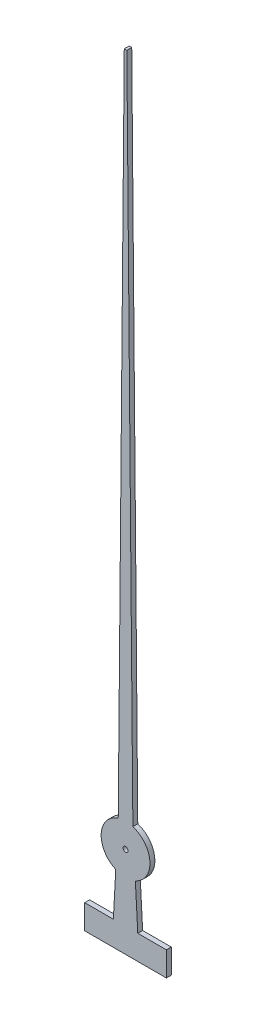
ISO-10303-21;
HEADER;
FILE_DESCRIPTION(('STEP AP214'),'2;1');
FILE_NAME('part.step','',(''),(''),'','','');
FILE_SCHEMA(('AUTOMOTIVE_DESIGN { 1 0 10303 214 1 1 1 1 }'));
ENDSEC;
DATA;
#1=APPLICATION_CONTEXT('core data for automotive mechanical design processes');
#2=APPLICATION_PROTOCOL_DEFINITION('international standard','automotive_design',2000,#1);
#3=PRODUCT_CONTEXT('',#1,'mechanical');
#4=PRODUCT('Part','Part','',(#3));
#5=PRODUCT_RELATED_PRODUCT_CATEGORY('part','',(#4));
#6=PRODUCT_DEFINITION_FORMATION('','',#4);
#7=PRODUCT_DEFINITION_CONTEXT('part definition',#1,'design');
#8=PRODUCT_DEFINITION('design','',#6,#7);
#9=PRODUCT_DEFINITION_SHAPE('','',#8);
#10=(LENGTH_UNIT() NAMED_UNIT(*) SI_UNIT(.MILLI.,.METRE.));
#11=(NAMED_UNIT(*) PLANE_ANGLE_UNIT() SI_UNIT($,.RADIAN.));
#12=(NAMED_UNIT(*) SI_UNIT($,.STERADIAN.) SOLID_ANGLE_UNIT());
#13=UNCERTAINTY_MEASURE_WITH_UNIT(LENGTH_MEASURE(1.E-05),#10,'distance_accuracy_value','');
#14=(GEOMETRIC_REPRESENTATION_CONTEXT(3) GLOBAL_UNCERTAINTY_ASSIGNED_CONTEXT((#13)) GLOBAL_UNIT_ASSIGNED_CONTEXT((#10,
#11,#12)) REPRESENTATION_CONTEXT('',''));
#15=CARTESIAN_POINT('',(0.,0.,0.));
#16=DIRECTION('',(0.,0.,1.));
#17=DIRECTION('',(1.,0.,0.));
#18=AXIS2_PLACEMENT_3D('',#15,#16,#17);
#19=CARTESIAN_POINT('',(0.,0.,0.1));
#20=DIRECTION('',(0.,0.,1.));
#21=DIRECTION('',(1.,0.,0.));
#22=AXIS2_PLACEMENT_3D('',#19,#20,#21);
#23=PLANE('',#22);
#24=CARTESIAN_POINT('',(0.,0.,0.1));
#25=DIRECTION('',(0.,0.,1.));
#26=DIRECTION('',(1.,0.,0.));
#27=AXIS2_PLACEMENT_3D('',#24,#25,#26);
#28=CIRCLE('',#27,0.5);
#29=CARTESIAN_POINT('',(0.200773833253495,-0.457919062587154,0.1));
#30=VERTEX_POINT('',#29);
#31=CARTESIAN_POINT('',(0.150000000000001,0.476969600708472,0.1));
#32=VERTEX_POINT('',#31);
#33=EDGE_CURVE('E177',#30,#32,#28,.T.);
#34=ORIENTED_EDGE('',*,*,#33,.T.);
#35=DIRECTION('',(-0.00900450339221929,0.999959458637529,0.));
#36=VECTOR('',#35,1.);
#37=CARTESIAN_POINT('',(0.150000000000001,0.476969600708472,0.1));
#38=LINE('',#37,#36);
#39=CARTESIAN_POINT('',(0.0265262633769825,14.1888563590826,0.1));
#40=VERTEX_POINT('',#39);
#41=EDGE_CURVE('E105',#32,#40,#38,.T.);
#42=ORIENTED_EDGE('',*,*,#41,.T.);
#43=DIRECTION('',(-1.,0.,0.));
#44=VECTOR('',#43,1.);
#45=CARTESIAN_POINT('',(-0.0265262633769822,14.1888563590826,0.1));
#46=LINE('',#45,#44);
#47=CARTESIAN_POINT('',(-0.0265262633769822,14.1888563590826,0.1));
#48=VERTEX_POINT('',#47);
#49=EDGE_CURVE('E204',#40,#48,#46,.T.);
#50=ORIENTED_EDGE('',*,*,#49,.T.);
#51=DIRECTION('',(-0.0090045033922193,-0.999959458637529,0.));
#52=VECTOR('',#51,1.);
#53=CARTESIAN_POINT('',(-0.150000000000001,0.476969600708472,0.1));
#54=LINE('',#53,#52);
#55=CARTESIAN_POINT('',(-0.150000000000001,0.476969600708472,0.1));
#56=VERTEX_POINT('',#55);
#57=EDGE_CURVE('E223',#48,#56,#54,.T.);
#58=ORIENTED_EDGE('',*,*,#57,.T.);
#59=CARTESIAN_POINT('',(0.,0.,0.1));
#60=DIRECTION('',(0.,0.,1.));
#61=DIRECTION('',(1.,0.,0.));
#62=AXIS2_PLACEMENT_3D('',#59,#60,#61);
#63=CIRCLE('',#62,0.5);
#64=CARTESIAN_POINT('',(-0.200773833253495,-0.457919062587154,0.1));
#65=VERTEX_POINT('',#64);
#66=EDGE_CURVE('E220',#56,#65,#63,.T.);
#67=ORIENTED_EDGE('',*,*,#66,.T.);
#68=DIRECTION('',(-0.0542301129075481,-0.998528464718975,0.));
#69=VECTOR('',#68,1.);
#70=CARTESIAN_POINT('',(-0.200773833253495,-0.457919062587154,0.1));
#71=LINE('',#70,#69);
#72=CARTESIAN_POINT('',(-0.25,-1.36431084512291,0.1));
#73=VERTEX_POINT('',#72);
#74=EDGE_CURVE('E222',#65,#73,#71,.T.);
#75=ORIENTED_EDGE('',*,*,#74,.T.);
#76=DIRECTION('',(-1.,0.,0.));
#77=VECTOR('',#76,1.);
#78=CARTESIAN_POINT('',(-0.25,-1.36431084512291,0.1));
#79=LINE('',#78,#77);
#80=CARTESIAN_POINT('',(-0.836414696541291,-1.36431084512291,0.1));
#81=VERTEX_POINT('',#80);
#82=EDGE_CURVE('E225',#73,#81,#79,.T.);
#83=ORIENTED_EDGE('',*,*,#82,.T.);
#84=DIRECTION('',(0.,-1.,0.));
#85=VECTOR('',#84,1.);
#86=CARTESIAN_POINT('',(-0.836414696541291,-1.36431084512291,0.1));
#87=LINE('',#86,#85);
#88=CARTESIAN_POINT('',(-0.836414696541291,-1.86431084512291,0.1));
#89=VERTEX_POINT('',#88);
#90=EDGE_CURVE('E231',#81,#89,#87,.T.);
#91=ORIENTED_EDGE('',*,*,#90,.T.);
#92=DIRECTION('',(1.,0.,0.));
#93=VECTOR('',#92,1.);
#94=CARTESIAN_POINT('',(-0.836414696541291,-1.86431084512291,0.1));
#95=LINE('',#94,#93);
#96=CARTESIAN_POINT('',(0.836414696541291,-1.86431084512291,0.1));
#97=VERTEX_POINT('',#96);
#98=EDGE_CURVE('E136',#89,#97,#95,.T.);
#99=ORIENTED_EDGE('',*,*,#98,.T.);
#100=DIRECTION('',(0.,1.,0.));
#101=VECTOR('',#100,1.);
#102=CARTESIAN_POINT('',(0.836414696541291,-1.36431084512291,0.1));
#103=LINE('',#102,#101);
#104=CARTESIAN_POINT('',(0.836414696541291,-1.36431084512291,0.1));
#105=VERTEX_POINT('',#104);
#106=EDGE_CURVE('E130',#97,#105,#103,.T.);
#107=ORIENTED_EDGE('',*,*,#106,.T.);
#108=DIRECTION('',(-1.,0.,0.));
#109=VECTOR('',#108,1.);
#110=CARTESIAN_POINT('',(0.25,-1.36431084512291,0.1));
#111=LINE('',#110,#109);
#112=CARTESIAN_POINT('',(0.25,-1.36431084512291,0.1));
#113=VERTEX_POINT('',#112);
#114=EDGE_CURVE('E134',#105,#113,#111,.T.);
#115=ORIENTED_EDGE('',*,*,#114,.T.);
#116=DIRECTION('',(-0.0542301129075481,0.998528464718975,0.));
#117=VECTOR('',#116,1.);
#118=CARTESIAN_POINT('',(0.200773833253495,-0.457919062587154,0.1));
#119=LINE('',#118,#117);
#120=EDGE_CURVE('E50',#113,#30,#119,.T.);
#121=ORIENTED_EDGE('',*,*,#120,.T.);
#122=EDGE_LOOP('',(#34,#42,#50,#58,#67,#75,#83,#91,#99,#107,#115,#121));
#123=FACE_BOUND('',#122,.T.);
#124=CARTESIAN_POINT('',(0.,0.,0.1));
#125=DIRECTION('',(0.,0.,1.));
#126=DIRECTION('',(1.,0.,0.));
#127=AXIS2_PLACEMENT_3D('',#124,#125,#126);
#128=CIRCLE('',#127,0.05);
#129=CARTESIAN_POINT('',(0.0500000000000001,0.,0.1));
#130=VERTEX_POINT('',#129);
#131=EDGE_CURVE('E158',#130,#130,#128,.T.);
#132=ORIENTED_EDGE('',*,*,#131,.F.);
#133=EDGE_LOOP('',(#132));
#134=FACE_BOUND('',#133,.T.);
#135=ADVANCED_FACE('F33',(#123,#134),#23,.T.);
#136=CARTESIAN_POINT('',(0.,0.,0.));
#137=DIRECTION('',(0.,0.,1.));
#138=DIRECTION('',(1.,0.,0.));
#139=AXIS2_PLACEMENT_3D('',#136,#137,#138);
#140=PLANE('',#139);
#141=CARTESIAN_POINT('',(0.,0.,0.));
#142=DIRECTION('',(0.,0.,1.));
#143=DIRECTION('',(1.,0.,0.));
#144=AXIS2_PLACEMENT_3D('',#141,#142,#143);
#145=CIRCLE('',#144,0.5);
#146=CARTESIAN_POINT('',(0.200773833253495,-0.457919062587154,0.));
#147=VERTEX_POINT('',#146);
#148=CARTESIAN_POINT('',(0.150000000000001,0.476969600708472,0.));
#149=VERTEX_POINT('',#148);
#150=EDGE_CURVE('E154',#147,#149,#145,.T.);
#151=ORIENTED_EDGE('',*,*,#150,.F.);
#152=DIRECTION('',(-0.0542301129075481,0.998528464718975,0.));
#153=VECTOR('',#152,1.);
#154=CARTESIAN_POINT('',(0.200773833253495,-0.457919062587154,0.));
#155=LINE('',#154,#153);
#156=CARTESIAN_POINT('',(0.25,-1.36431084512291,0.));
#157=VERTEX_POINT('',#156);
#158=EDGE_CURVE('E97',#157,#147,#155,.T.);
#159=ORIENTED_EDGE('',*,*,#158,.F.);
#160=DIRECTION('',(-1.,0.,0.));
#161=VECTOR('',#160,1.);
#162=CARTESIAN_POINT('',(0.25,-1.36431084512291,0.));
#163=LINE('',#162,#161);
#164=CARTESIAN_POINT('',(0.836414696541291,-1.36431084512291,0.));
#165=VERTEX_POINT('',#164);
#166=EDGE_CURVE('E91',#165,#157,#163,.T.);
#167=ORIENTED_EDGE('',*,*,#166,.F.);
#168=DIRECTION('',(0.,1.,0.));
#169=VECTOR('',#168,1.);
#170=CARTESIAN_POINT('',(0.836414696541291,-1.36431084512291,0.));
#171=LINE('',#170,#169);
#172=CARTESIAN_POINT('',(0.836414696541291,-1.86431084512291,0.));
#173=VERTEX_POINT('',#172);
#174=EDGE_CURVE('E144',#173,#165,#171,.T.);
#175=ORIENTED_EDGE('',*,*,#174,.F.);
#176=DIRECTION('',(1.,0.,0.));
#177=VECTOR('',#176,1.);
#178=CARTESIAN_POINT('',(-0.836414696541291,-1.86431084512291,0.));
#179=LINE('',#178,#177);
#180=CARTESIAN_POINT('',(-0.836414696541291,-1.86431084512291,0.));
#181=VERTEX_POINT('',#180);
#182=EDGE_CURVE('E172',#181,#173,#179,.T.);
#183=ORIENTED_EDGE('',*,*,#182,.F.);
#184=DIRECTION('',(0.,-1.,0.));
#185=VECTOR('',#184,1.);
#186=CARTESIAN_POINT('',(-0.836414696541291,-1.36431084512291,0.));
#187=LINE('',#186,#185);
#188=CARTESIAN_POINT('',(-0.836414696541291,-1.36431084512291,0.));
#189=VERTEX_POINT('',#188);
#190=EDGE_CURVE('E170',#189,#181,#187,.T.);
#191=ORIENTED_EDGE('',*,*,#190,.F.);
#192=DIRECTION('',(-1.,0.,0.));
#193=VECTOR('',#192,1.);
#194=CARTESIAN_POINT('',(-0.25,-1.36431084512291,0.));
#195=LINE('',#194,#193);
#196=CARTESIAN_POINT('',(-0.25,-1.36431084512291,0.));
#197=VERTEX_POINT('',#196);
#198=EDGE_CURVE('E168',#197,#189,#195,.T.);
#199=ORIENTED_EDGE('',*,*,#198,.F.);
#200=DIRECTION('',(-0.0542301129075481,-0.998528464718975,0.));
#201=VECTOR('',#200,1.);
#202=CARTESIAN_POINT('',(-0.200773833253495,-0.457919062587154,0.));
#203=LINE('',#202,#201);
#204=CARTESIAN_POINT('',(-0.200773833253495,-0.457919062587154,0.));
#205=VERTEX_POINT('',#204);
#206=EDGE_CURVE('E166',#205,#197,#203,.T.);
#207=ORIENTED_EDGE('',*,*,#206,.F.);
#208=CARTESIAN_POINT('',(0.,0.,0.));
#209=DIRECTION('',(0.,0.,1.));
#210=DIRECTION('',(1.,0.,0.));
#211=AXIS2_PLACEMENT_3D('',#208,#209,#210);
#212=CIRCLE('',#211,0.5);
#213=CARTESIAN_POINT('',(-0.150000000000001,0.476969600708472,0.));
#214=VERTEX_POINT('',#213);
#215=EDGE_CURVE('E164',#214,#205,#212,.T.);
#216=ORIENTED_EDGE('',*,*,#215,.F.);
#217=DIRECTION('',(-0.0090045033922193,-0.999959458637529,0.));
#218=VECTOR('',#217,1.);
#219=CARTESIAN_POINT('',(-0.150000000000001,0.476969600708472,0.));
#220=LINE('',#219,#218);
#221=CARTESIAN_POINT('',(-0.0265262633769822,14.1888563590826,0.));
#222=VERTEX_POINT('',#221);
#223=EDGE_CURVE('E162',#222,#214,#220,.T.);
#224=ORIENTED_EDGE('',*,*,#223,.F.);
#225=DIRECTION('',(-1.,0.,0.));
#226=VECTOR('',#225,1.);
#227=CARTESIAN_POINT('',(-0.0265262633769822,14.1888563590826,0.));
#228=LINE('',#227,#226);
#229=CARTESIAN_POINT('',(0.0265262633769825,14.1888563590826,0.));
#230=VERTEX_POINT('',#229);
#231=EDGE_CURVE('E160',#230,#222,#228,.T.);
#232=ORIENTED_EDGE('',*,*,#231,.F.);
#233=DIRECTION('',(-0.00900450339221929,0.999959458637529,0.));
#234=VECTOR('',#233,1.);
#235=CARTESIAN_POINT('',(0.150000000000001,0.476969600708472,0.));
#236=LINE('',#235,#234);
#237=EDGE_CURVE('E157',#149,#230,#236,.T.);
#238=ORIENTED_EDGE('',*,*,#237,.F.);
#239=EDGE_LOOP('',(#151,#159,#167,#175,#183,#191,#199,#207,#216,#224,#232,#238));
#240=FACE_BOUND('',#239,.T.);
#241=CARTESIAN_POINT('',(0.,0.,0.));
#242=DIRECTION('',(0.,0.,1.));
#243=DIRECTION('',(1.,0.,0.));
#244=AXIS2_PLACEMENT_3D('',#241,#242,#243);
#245=CIRCLE('',#244,0.05);
#246=CARTESIAN_POINT('',(0.0500000000000001,0.,0.));
#247=VERTEX_POINT('',#246);
#248=EDGE_CURVE('E378',#247,#247,#245,.T.);
#249=ORIENTED_EDGE('',*,*,#248,.T.);
#250=EDGE_LOOP('',(#249));
#251=FACE_BOUND('',#250,.T.);
#252=ADVANCED_FACE('F208',(#240,#251),#140,.F.);
#253=CARTESIAN_POINT('',(0.,0.,0.1));
#254=DIRECTION('',(0.,0.,-1.));
#255=DIRECTION('',(-1.,0.,0.));
#256=AXIS2_PLACEMENT_3D('',#253,#254,#255);
#257=CYLINDRICAL_SURFACE('',#256,0.5);
#258=ORIENTED_EDGE('',*,*,#150,.T.);
#259=DIRECTION('',(0.,0.,-1.));
#260=VECTOR('',#259,1.);
#261=CARTESIAN_POINT('',(0.150000000000001,0.476969600708472,0.1));
#262=LINE('',#261,#260);
#263=EDGE_CURVE('E11',#32,#149,#262,.T.);
#264=ORIENTED_EDGE('',*,*,#263,.F.);
#265=ORIENTED_EDGE('',*,*,#33,.F.);
#266=DIRECTION('',(0.,0.,-1.));
#267=VECTOR('',#266,1.);
#268=CARTESIAN_POINT('',(0.200773833253495,-0.457919062587154,0.1));
#269=LINE('',#268,#267);
#270=EDGE_CURVE('E150',#30,#147,#269,.T.);
#271=ORIENTED_EDGE('',*,*,#270,.T.);
#272=EDGE_LOOP('',(#258,#264,#265,#271));
#273=FACE_BOUND('',#272,.T.);
#274=ADVANCED_FACE('F35',(#273),#257,.T.);
#275=CARTESIAN_POINT('',(0.150000000000001,0.476969600708472,0.1));
#276=DIRECTION('',(-0.999959458637529,-0.00900450339221929,0.));
#277=DIRECTION('',(0.00900450339221929,-0.999959458637529,0.));
#278=AXIS2_PLACEMENT_3D('',#275,#276,#277);
#279=PLANE('',#278);
#280=ORIENTED_EDGE('',*,*,#237,.T.);
#281=DIRECTION('',(0.,0.,-1.));
#282=VECTOR('',#281,1.);
#283=CARTESIAN_POINT('',(0.0265262633769825,14.1888563590826,0.1));
#284=LINE('',#283,#282);
#285=EDGE_CURVE('E42',#40,#230,#284,.T.);
#286=ORIENTED_EDGE('',*,*,#285,.F.);
#287=ORIENTED_EDGE('',*,*,#41,.F.);
#288=ORIENTED_EDGE('',*,*,#263,.T.);
#289=EDGE_LOOP('',(#280,#286,#287,#288));
#290=FACE_BOUND('',#289,.T.);
#291=ADVANCED_FACE('F265',(#290),#279,.F.);
#292=CARTESIAN_POINT('',(-0.0265262633769822,14.1888563590826,0.1));
#293=DIRECTION('',(0.,-1.,0.));
#294=DIRECTION('',(0.,0.,-1.));
#295=AXIS2_PLACEMENT_3D('',#292,#293,#294);
#296=PLANE('',#295);
#297=ORIENTED_EDGE('',*,*,#231,.T.);
#298=DIRECTION('',(0.,0.,-1.));
#299=VECTOR('',#298,1.);
#300=CARTESIAN_POINT('',(-0.0265262633769822,14.1888563590826,0.1));
#301=LINE('',#300,#299);
#302=EDGE_CURVE('E196',#48,#222,#301,.T.);
#303=ORIENTED_EDGE('',*,*,#302,.F.);
#304=ORIENTED_EDGE('',*,*,#49,.F.);
#305=ORIENTED_EDGE('',*,*,#285,.T.);
#306=EDGE_LOOP('',(#297,#303,#304,#305));
#307=FACE_BOUND('',#306,.T.);
#308=ADVANCED_FACE('F202',(#307),#296,.F.);
#309=CARTESIAN_POINT('',(-0.150000000000001,0.476969600708472,0.1));
#310=DIRECTION('',(0.999959458637529,-0.0090045033922193,0.));
#311=DIRECTION('',(0.0090045033922193,0.999959458637529,0.));
#312=AXIS2_PLACEMENT_3D('',#309,#310,#311);
#313=PLANE('',#312);
#314=ORIENTED_EDGE('',*,*,#223,.T.);
#315=DIRECTION('',(0.,0.,-1.));
#316=VECTOR('',#315,1.);
#317=CARTESIAN_POINT('',(-0.150000000000001,0.476969600708472,0.1));
#318=LINE('',#317,#316);
#319=EDGE_CURVE('E193',#56,#214,#318,.T.);
#320=ORIENTED_EDGE('',*,*,#319,.F.);
#321=ORIENTED_EDGE('',*,*,#57,.F.);
#322=ORIENTED_EDGE('',*,*,#302,.T.);
#323=EDGE_LOOP('',(#314,#320,#321,#322));
#324=FACE_BOUND('',#323,.T.);
#325=ADVANCED_FACE('F214',(#324),#313,.F.);
#326=CARTESIAN_POINT('',(0.,0.,0.1));
#327=DIRECTION('',(0.,0.,-1.));
#328=DIRECTION('',(-1.,0.,0.));
#329=AXIS2_PLACEMENT_3D('',#326,#327,#328);
#330=CYLINDRICAL_SURFACE('',#329,0.5);
#331=ORIENTED_EDGE('',*,*,#215,.T.);
#332=DIRECTION('',(0.,0.,-1.));
#333=VECTOR('',#332,1.);
#334=CARTESIAN_POINT('',(-0.200773833253495,-0.457919062587154,0.1));
#335=LINE('',#334,#333);
#336=EDGE_CURVE('E190',#65,#205,#335,.T.);
#337=ORIENTED_EDGE('',*,*,#336,.F.);
#338=ORIENTED_EDGE('',*,*,#66,.F.);
#339=ORIENTED_EDGE('',*,*,#319,.T.);
#340=EDGE_LOOP('',(#331,#337,#338,#339));
#341=FACE_BOUND('',#340,.T.);
#342=ADVANCED_FACE('F218',(#341),#330,.T.);
#343=CARTESIAN_POINT('',(-0.200773833253495,-0.457919062587154,0.1));
#344=DIRECTION('',(0.998528464718976,-0.0542301129075481,0.));
#345=DIRECTION('',(0.0542301129075481,0.998528464718976,0.));
#346=AXIS2_PLACEMENT_3D('',#343,#344,#345);
#347=PLANE('',#346);
#348=ORIENTED_EDGE('',*,*,#206,.T.);
#349=DIRECTION('',(0.,0.,-1.));
#350=VECTOR('',#349,1.);
#351=CARTESIAN_POINT('',(-0.25,-1.36431084512291,0.1));
#352=LINE('',#351,#350);
#353=EDGE_CURVE('E187',#73,#197,#352,.T.);
#354=ORIENTED_EDGE('',*,*,#353,.F.);
#355=ORIENTED_EDGE('',*,*,#74,.F.);
#356=ORIENTED_EDGE('',*,*,#336,.T.);
#357=EDGE_LOOP('',(#348,#354,#355,#356));
#358=FACE_BOUND('',#357,.T.);
#359=ADVANCED_FACE('F278',(#358),#347,.F.);
#360=CARTESIAN_POINT('',(-0.25,-1.36431084512291,0.1));
#361=DIRECTION('',(0.,-1.,0.));
#362=DIRECTION('',(0.,0.,-1.));
#363=AXIS2_PLACEMENT_3D('',#360,#361,#362);
#364=PLANE('',#363);
#365=ORIENTED_EDGE('',*,*,#198,.T.);
#366=DIRECTION('',(0.,0.,-1.));
#367=VECTOR('',#366,1.);
#368=CARTESIAN_POINT('',(-0.836414696541291,-1.36431084512291,0.1));
#369=LINE('',#368,#367);
#370=EDGE_CURVE('E184',#81,#189,#369,.T.);
#371=ORIENTED_EDGE('',*,*,#370,.F.);
#372=ORIENTED_EDGE('',*,*,#82,.F.);
#373=ORIENTED_EDGE('',*,*,#353,.T.);
#374=EDGE_LOOP('',(#365,#371,#372,#373));
#375=FACE_BOUND('',#374,.T.);
#376=ADVANCED_FACE('F281',(#375),#364,.F.);
#377=CARTESIAN_POINT('',(-0.836414696541291,-1.36431084512291,0.1));
#378=DIRECTION('',(1.,0.,0.));
#379=DIRECTION('',(0.,0.,-1.));
#380=AXIS2_PLACEMENT_3D('',#377,#378,#379);
#381=PLANE('',#380);
#382=ORIENTED_EDGE('',*,*,#190,.T.);
#383=DIRECTION('',(0.,0.,-1.));
#384=VECTOR('',#383,1.);
#385=CARTESIAN_POINT('',(-0.836414696541291,-1.86431084512291,0.1));
#386=LINE('',#385,#384);
#387=EDGE_CURVE('E181',#89,#181,#386,.T.);
#388=ORIENTED_EDGE('',*,*,#387,.F.);
#389=ORIENTED_EDGE('',*,*,#90,.F.);
#390=ORIENTED_EDGE('',*,*,#370,.T.);
#391=EDGE_LOOP('',(#382,#388,#389,#390));
#392=FACE_BOUND('',#391,.T.);
#393=ADVANCED_FACE('F237',(#392),#381,.F.);
#394=CARTESIAN_POINT('',(-0.836414696541291,-1.86431084512291,0.1));
#395=DIRECTION('',(0.,1.,0.));
#396=DIRECTION('',(0.,0.,1.));
#397=AXIS2_PLACEMENT_3D('',#394,#395,#396);
#398=PLANE('',#397);
#399=ORIENTED_EDGE('',*,*,#182,.T.);
#400=DIRECTION('',(0.,0.,-1.));
#401=VECTOR('',#400,1.);
#402=CARTESIAN_POINT('',(0.836414696541291,-1.86431084512291,0.1));
#403=LINE('',#402,#401);
#404=EDGE_CURVE('E145',#97,#173,#403,.T.);
#405=ORIENTED_EDGE('',*,*,#404,.F.);
#406=ORIENTED_EDGE('',*,*,#98,.F.);
#407=ORIENTED_EDGE('',*,*,#387,.T.);
#408=EDGE_LOOP('',(#399,#405,#406,#407));
#409=FACE_BOUND('',#408,.T.);
#410=ADVANCED_FACE('F241',(#409),#398,.F.);
#411=CARTESIAN_POINT('',(0.836414696541291,-1.36431084512291,0.1));
#412=DIRECTION('',(-1.,0.,0.));
#413=DIRECTION('',(0.,0.,1.));
#414=AXIS2_PLACEMENT_3D('',#411,#412,#413);
#415=PLANE('',#414);
#416=ORIENTED_EDGE('',*,*,#174,.T.);
#417=DIRECTION('',(0.,0.,-1.));
#418=VECTOR('',#417,1.);
#419=CARTESIAN_POINT('',(0.836414696541291,-1.36431084512291,0.1));
#420=LINE('',#419,#418);
#421=EDGE_CURVE('E141',#105,#165,#420,.T.);
#422=ORIENTED_EDGE('',*,*,#421,.F.);
#423=ORIENTED_EDGE('',*,*,#106,.F.);
#424=ORIENTED_EDGE('',*,*,#404,.T.);
#425=EDGE_LOOP('',(#416,#422,#423,#424));
#426=FACE_BOUND('',#425,.T.);
#427=ADVANCED_FACE('F142',(#426),#415,.F.);
#428=CARTESIAN_POINT('',(0.25,-1.36431084512291,0.1));
#429=DIRECTION('',(0.,-1.,0.));
#430=DIRECTION('',(0.,0.,-1.));
#431=AXIS2_PLACEMENT_3D('',#428,#429,#430);
#432=PLANE('',#431);
#433=ORIENTED_EDGE('',*,*,#166,.T.);
#434=DIRECTION('',(0.,0.,-1.));
#435=VECTOR('',#434,1.);
#436=CARTESIAN_POINT('',(0.25,-1.36431084512291,0.1));
#437=LINE('',#436,#435);
#438=EDGE_CURVE('E146',#113,#157,#437,.T.);
#439=ORIENTED_EDGE('',*,*,#438,.F.);
#440=ORIENTED_EDGE('',*,*,#114,.F.);
#441=ORIENTED_EDGE('',*,*,#421,.T.);
#442=EDGE_LOOP('',(#433,#439,#440,#441));
#443=FACE_BOUND('',#442,.T.);
#444=ADVANCED_FACE('F148',(#443),#432,.F.);
#445=CARTESIAN_POINT('',(0.200773833253495,-0.457919062587154,0.1));
#446=DIRECTION('',(-0.998528464718976,-0.0542301129075481,0.));
#447=DIRECTION('',(0.0542301129075481,-0.998528464718976,0.));
#448=AXIS2_PLACEMENT_3D('',#445,#446,#447);
#449=PLANE('',#448);
#450=ORIENTED_EDGE('',*,*,#158,.T.);
#451=ORIENTED_EDGE('',*,*,#270,.F.);
#452=ORIENTED_EDGE('',*,*,#120,.F.);
#453=ORIENTED_EDGE('',*,*,#438,.T.);
#454=EDGE_LOOP('',(#450,#451,#452,#453));
#455=FACE_BOUND('',#454,.T.);
#456=ADVANCED_FACE('F245',(#455),#449,.F.);
#457=CARTESIAN_POINT('',(0.,0.,0.1));
#458=DIRECTION('',(0.,0.,-1.));
#459=DIRECTION('',(-1.,0.,0.));
#460=AXIS2_PLACEMENT_3D('',#457,#458,#459);
#461=CYLINDRICAL_SURFACE('',#460,0.05);
#462=ORIENTED_EDGE('',*,*,#131,.T.);
#463=EDGE_LOOP('',(#462));
#464=FACE_BOUND('',#463,.T.);
#465=ORIENTED_EDGE('',*,*,#248,.F.);
#466=EDGE_LOOP('',(#465));
#467=FACE_BOUND('',#466,.T.);
#468=ADVANCED_FACE('F247',(#464,#467),#461,.F.);
#469=CLOSED_SHELL('',(#135,#252,#274,#291,#308,#325,#342,#359,#376,#393,#410,#427,#444,#456,#468));
#470=MANIFOLD_SOLID_BREP('B2',#469);
#471=ADVANCED_BREP_SHAPE_REPRESENTATION('',(#18,#470),#14);
#472=SHAPE_DEFINITION_REPRESENTATION(#9,#471);
ENDSEC;
END-ISO-10303-21;
